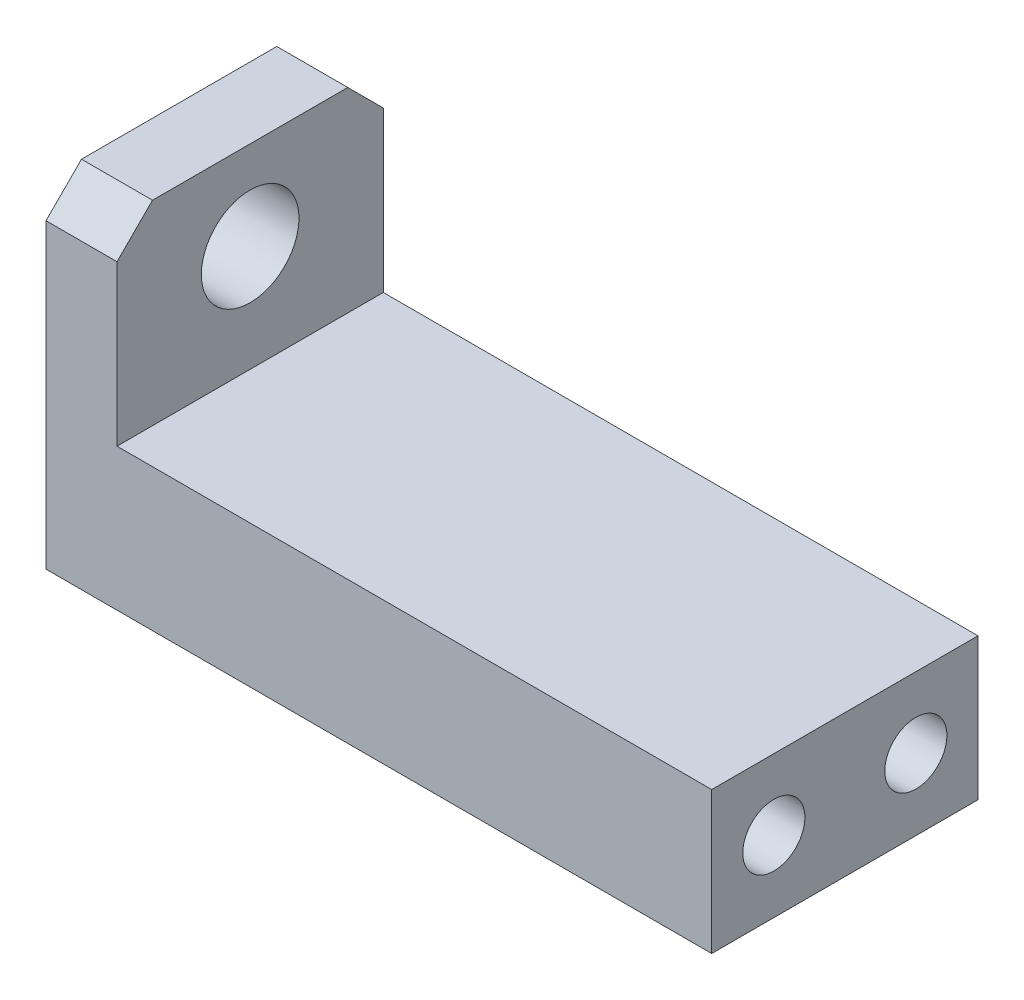
ISO-10303-21;
HEADER;
FILE_DESCRIPTION(('STEP AP214'),'2;1');
FILE_NAME('part.step','',(''),(''),'','','');
FILE_SCHEMA(('AUTOMOTIVE_DESIGN { 1 0 10303 214 1 1 1 1 }'));
ENDSEC;
DATA;
#1=APPLICATION_CONTEXT('core data for automotive mechanical design processes');
#2=APPLICATION_PROTOCOL_DEFINITION('international standard','automotive_design',2000,#1);
#3=PRODUCT_CONTEXT('',#1,'mechanical');
#4=PRODUCT('Part','Part','',(#3));
#5=PRODUCT_RELATED_PRODUCT_CATEGORY('part','',(#4));
#6=PRODUCT_DEFINITION_FORMATION('','',#4);
#7=PRODUCT_DEFINITION_CONTEXT('part definition',#1,'design');
#8=PRODUCT_DEFINITION('design','',#6,#7);
#9=PRODUCT_DEFINITION_SHAPE('','',#8);
#10=(LENGTH_UNIT() NAMED_UNIT(*) SI_UNIT(.MILLI.,.METRE.));
#11=(NAMED_UNIT(*) PLANE_ANGLE_UNIT() SI_UNIT($,.RADIAN.));
#12=(NAMED_UNIT(*) SI_UNIT($,.STERADIAN.) SOLID_ANGLE_UNIT());
#13=UNCERTAINTY_MEASURE_WITH_UNIT(LENGTH_MEASURE(1.E-05),#10,'distance_accuracy_value','');
#14=(GEOMETRIC_REPRESENTATION_CONTEXT(3) GLOBAL_UNCERTAINTY_ASSIGNED_CONTEXT((#13)) GLOBAL_UNIT_ASSIGNED_CONTEXT((#10,
#11,#12)) REPRESENTATION_CONTEXT('',''));
#15=CARTESIAN_POINT('',(0.,0.,0.));
#16=DIRECTION('',(0.,0.,1.));
#17=DIRECTION('',(1.,0.,0.));
#18=AXIS2_PLACEMENT_3D('',#15,#16,#17);
#19=CARTESIAN_POINT('',(-12.1637099173446,-16.9398496240602,15.));
#20=DIRECTION('',(1.,0.,0.));
#21=DIRECTION('',(0.,0.,-1.));
#22=AXIS2_PLACEMENT_3D('',#19,#20,#21);
#23=PLANE('',#22);
#24=CARTESIAN_POINT('',(-12.1637099173446,-12.9147060324,11.5));
#25=DIRECTION('',(-1.,0.,0.));
#26=DIRECTION('',(0.,0.,1.));
#27=AXIS2_PLACEMENT_3D('',#24,#25,#26);
#28=CIRCLE('',#27,3.);
#29=CARTESIAN_POINT('',(-12.1637099173446,-12.9147060324,14.5));
#30=VERTEX_POINT('',#29);
#31=EDGE_CURVE('E194',#30,#30,#28,.T.);
#32=ORIENTED_EDGE('',*,*,#31,.F.);
#33=EDGE_LOOP('',(#32));
#34=FACE_BOUND('',#33,.T.);
#35=CARTESIAN_POINT('',(-12.1637099173446,-12.9147060324,3.5));
#36=DIRECTION('',(-1.,0.,0.));
#37=DIRECTION('',(0.,0.,1.));
#38=AXIS2_PLACEMENT_3D('',#35,#36,#37);
#39=CIRCLE('',#38,3.);
#40=CARTESIAN_POINT('',(-12.1637099173446,-12.9147060324,6.5));
#41=VERTEX_POINT('',#40);
#42=EDGE_CURVE('E187',#41,#41,#39,.T.);
#43=ORIENTED_EDGE('',*,*,#42,.F.);
#44=EDGE_LOOP('',(#43));
#45=FACE_BOUND('',#44,.T.);
#46=CARTESIAN_POINT('',(-12.1637099173446,-2.93984962406015,7.5));
#47=DIRECTION('',(-1.,0.,0.));
#48=DIRECTION('',(0.,0.,1.));
#49=AXIS2_PLACEMENT_3D('',#46,#47,#48);
#50=CIRCLE('',#49,2.75);
#51=CARTESIAN_POINT('',(-12.1637099173446,-2.93984962406015,10.25));
#52=VERTEX_POINT('',#51);
#53=EDGE_CURVE('E133',#52,#52,#50,.T.);
#54=ORIENTED_EDGE('',*,*,#53,.F.);
#55=EDGE_LOOP('',(#54));
#56=FACE_BOUND('',#55,.T.);
#57=DIRECTION('',(0.,0.,-1.));
#58=VECTOR('',#57,1.);
#59=CARTESIAN_POINT('',(-12.1637099173446,2.06015037593985,15.));
#60=LINE('',#59,#58);
#61=CARTESIAN_POINT('',(-12.1637099173446,2.06015037593985,13.));
#62=VERTEX_POINT('',#61);
#63=CARTESIAN_POINT('',(-12.1637099173446,2.06015037593985,1.99999999999999));
#64=VERTEX_POINT('',#63);
#65=EDGE_CURVE('E154',#62,#64,#60,.T.);
#66=ORIENTED_EDGE('',*,*,#65,.T.);
#67=DIRECTION('',(0.,-0.70710678118655,-0.707106781186545));
#68=VECTOR('',#67,1.);
#69=CARTESIAN_POINT('',(-12.1637099173446,2.06015037593985,1.99999999999999));
#70=LINE('',#69,#68);
#71=CARTESIAN_POINT('',(-12.1637099173446,0.0601503759398402,0.));
#72=VERTEX_POINT('',#71);
#73=EDGE_CURVE('E139',#64,#72,#70,.T.);
#74=ORIENTED_EDGE('',*,*,#73,.T.);
#75=DIRECTION('',(0.,-1.,0.));
#76=VECTOR('',#75,1.);
#77=CARTESIAN_POINT('',(-12.1637099173446,-16.9398496240602,0.));
#78=LINE('',#77,#76);
#79=CARTESIAN_POINT('',(-12.1637099173446,-16.9398496240602,0.));
#80=VERTEX_POINT('',#79);
#81=EDGE_CURVE('E121',#72,#80,#78,.T.);
#82=ORIENTED_EDGE('',*,*,#81,.T.);
#83=DIRECTION('',(0.,0.,-1.));
#84=VECTOR('',#83,1.);
#85=CARTESIAN_POINT('',(-12.1637099173446,-16.9398496240602,15.));
#86=LINE('',#85,#84);
#87=CARTESIAN_POINT('',(-12.1637099173446,-16.9398496240602,15.));
#88=VERTEX_POINT('',#87);
#89=EDGE_CURVE('E114',#88,#80,#86,.T.);
#90=ORIENTED_EDGE('',*,*,#89,.F.);
#91=DIRECTION('',(0.,-1.,0.));
#92=VECTOR('',#91,1.);
#93=CARTESIAN_POINT('',(-12.1637099173446,-16.9398496240602,15.));
#94=LINE('',#93,#92);
#95=CARTESIAN_POINT('',(-12.1637099173446,0.0601503759398471,15.));
#96=VERTEX_POINT('',#95);
#97=EDGE_CURVE('E101',#96,#88,#94,.T.);
#98=ORIENTED_EDGE('',*,*,#97,.F.);
#99=DIRECTION('',(0.,-0.707106781186545,0.70710678118655));
#100=VECTOR('',#99,1.);
#101=CARTESIAN_POINT('',(-12.1637099173446,0.0601503759398471,15.));
#102=LINE('',#101,#100);
#103=EDGE_CURVE('E137',#96,#62,#102,.F.);
#104=ORIENTED_EDGE('',*,*,#103,.T.);
#105=EDGE_LOOP('',(#66,#74,#82,#90,#98,#104));
#106=FACE_BOUND('',#105,.T.);
#107=ADVANCED_FACE('F33',(#34,#45,#56,#106),#23,.F.);
#108=CARTESIAN_POINT('',(25.3362900826554,-16.9398496240601,15.));
#109=DIRECTION('',(0.,1.,0.));
#110=DIRECTION('',(-1.,0.,0.));
#111=AXIS2_PLACEMENT_3D('',#108,#109,#110);
#112=PLANE('',#111);
#113=DIRECTION('',(1.,0.,0.));
#114=VECTOR('',#113,1.);
#115=CARTESIAN_POINT('',(25.3362900826554,-16.9398496240601,0.));
#116=LINE('',#115,#114);
#117=CARTESIAN_POINT('',(25.3362900826554,-16.9398496240601,0.));
#118=VERTEX_POINT('',#117);
#119=EDGE_CURVE('E159',#80,#118,#116,.T.);
#120=ORIENTED_EDGE('',*,*,#119,.T.);
#121=DIRECTION('',(0.,0.,-1.));
#122=VECTOR('',#121,1.);
#123=CARTESIAN_POINT('',(25.3362900826554,-16.9398496240601,15.));
#124=LINE('',#123,#122);
#125=CARTESIAN_POINT('',(25.3362900826554,-16.9398496240601,15.));
#126=VERTEX_POINT('',#125);
#127=EDGE_CURVE('E116',#126,#118,#124,.T.);
#128=ORIENTED_EDGE('',*,*,#127,.F.);
#129=DIRECTION('',(1.,0.,0.));
#130=VECTOR('',#129,1.);
#131=CARTESIAN_POINT('',(25.3362900826554,-16.9398496240601,15.));
#132=LINE('',#131,#130);
#133=EDGE_CURVE('E104',#88,#126,#132,.T.);
#134=ORIENTED_EDGE('',*,*,#133,.F.);
#135=ORIENTED_EDGE('',*,*,#89,.T.);
#136=EDGE_LOOP('',(#120,#128,#134,#135));
#137=FACE_BOUND('',#136,.T.);
#138=ADVANCED_FACE('F113',(#137),#112,.F.);
#139=CARTESIAN_POINT('',(25.3362900826554,-8.93984962406015,15.));
#140=DIRECTION('',(-1.,0.,0.));
#141=DIRECTION('',(0.,0.,1.));
#142=AXIS2_PLACEMENT_3D('',#139,#140,#141);
#143=PLANE('',#142);
#144=CARTESIAN_POINT('',(25.3362900826554,-12.9147060324,11.5));
#145=DIRECTION('',(-1.,0.,0.));
#146=DIRECTION('',(0.,0.,1.));
#147=AXIS2_PLACEMENT_3D('',#144,#145,#146);
#148=CIRCLE('',#147,1.75);
#149=CARTESIAN_POINT('',(25.3362900826554,-12.9147060324,13.25));
#150=VERTEX_POINT('',#149);
#151=EDGE_CURVE('E207',#150,#150,#148,.T.);
#152=ORIENTED_EDGE('',*,*,#151,.T.);
#153=EDGE_LOOP('',(#152));
#154=FACE_BOUND('',#153,.T.);
#155=CARTESIAN_POINT('',(25.3362900826554,-12.9147060324,3.5));
#156=DIRECTION('',(-1.,0.,0.));
#157=DIRECTION('',(0.,0.,1.));
#158=AXIS2_PLACEMENT_3D('',#155,#156,#157);
#159=CIRCLE('',#158,1.75);
#160=CARTESIAN_POINT('',(25.3362900826554,-12.9147060324,5.25));
#161=VERTEX_POINT('',#160);
#162=EDGE_CURVE('E201',#161,#161,#159,.T.);
#163=ORIENTED_EDGE('',*,*,#162,.T.);
#164=EDGE_LOOP('',(#163));
#165=FACE_BOUND('',#164,.T.);
#166=DIRECTION('',(0.,1.,0.));
#167=VECTOR('',#166,1.);
#168=CARTESIAN_POINT('',(25.3362900826554,-8.93984962406015,0.));
#169=LINE('',#168,#167);
#170=CARTESIAN_POINT('',(25.3362900826554,-8.93984962406015,0.));
#171=VERTEX_POINT('',#170);
#172=EDGE_CURVE('E161',#118,#171,#169,.T.);
#173=ORIENTED_EDGE('',*,*,#172,.T.);
#174=DIRECTION('',(0.,0.,-1.));
#175=VECTOR('',#174,1.);
#176=CARTESIAN_POINT('',(25.3362900826554,-8.93984962406015,15.));
#177=LINE('',#176,#175);
#178=CARTESIAN_POINT('',(25.3362900826554,-8.93984962406015,15.));
#179=VERTEX_POINT('',#178);
#180=EDGE_CURVE('E127',#179,#171,#177,.T.);
#181=ORIENTED_EDGE('',*,*,#180,.F.);
#182=DIRECTION('',(0.,1.,0.));
#183=VECTOR('',#182,1.);
#184=CARTESIAN_POINT('',(25.3362900826554,-8.93984962406015,15.));
#185=LINE('',#184,#183);
#186=EDGE_CURVE('E118',#126,#179,#185,.T.);
#187=ORIENTED_EDGE('',*,*,#186,.F.);
#188=ORIENTED_EDGE('',*,*,#127,.T.);
#189=EDGE_LOOP('',(#173,#181,#187,#188));
#190=FACE_BOUND('',#189,.T.);
#191=ADVANCED_FACE('F181',(#154,#165,#190),#143,.F.);
#192=CARTESIAN_POINT('',(-8.16370991734465,-8.93984962406015,15.));
#193=DIRECTION('',(0.,-1.,0.));
#194=DIRECTION('',(0.,0.,-1.));
#195=AXIS2_PLACEMENT_3D('',#192,#193,#194);
#196=PLANE('',#195);
#197=DIRECTION('',(-1.,0.,0.));
#198=VECTOR('',#197,1.);
#199=CARTESIAN_POINT('',(-8.16370991734465,-8.93984962406015,0.));
#200=LINE('',#199,#198);
#201=CARTESIAN_POINT('',(-8.16370991734465,-8.93984962406015,0.));
#202=VERTEX_POINT('',#201);
#203=EDGE_CURVE('E168',#171,#202,#200,.T.);
#204=ORIENTED_EDGE('',*,*,#203,.T.);
#205=DIRECTION('',(0.,0.,-1.));
#206=VECTOR('',#205,1.);
#207=CARTESIAN_POINT('',(-8.16370991734465,-8.93984962406015,15.));
#208=LINE('',#207,#206);
#209=CARTESIAN_POINT('',(-8.16370991734465,-8.93984962406015,15.));
#210=VERTEX_POINT('',#209);
#211=EDGE_CURVE('E153',#210,#202,#208,.T.);
#212=ORIENTED_EDGE('',*,*,#211,.F.);
#213=DIRECTION('',(-1.,0.,0.));
#214=VECTOR('',#213,1.);
#215=CARTESIAN_POINT('',(-8.16370991734465,-8.93984962406015,15.));
#216=LINE('',#215,#214);
#217=EDGE_CURVE('E179',#179,#210,#216,.T.);
#218=ORIENTED_EDGE('',*,*,#217,.F.);
#219=ORIENTED_EDGE('',*,*,#180,.T.);
#220=EDGE_LOOP('',(#204,#212,#218,#219));
#221=FACE_BOUND('',#220,.T.);
#222=ADVANCED_FACE('F177',(#221),#196,.F.);
#223=CARTESIAN_POINT('',(-8.16370991734465,2.06015037593985,15.));
#224=DIRECTION('',(-1.,0.,0.));
#225=DIRECTION('',(0.,0.,1.));
#226=AXIS2_PLACEMENT_3D('',#223,#224,#225);
#227=PLANE('',#226);
#228=CARTESIAN_POINT('',(-8.16370991734465,-2.93984962406015,7.5));
#229=DIRECTION('',(-1.,0.,0.));
#230=DIRECTION('',(0.,0.,1.));
#231=AXIS2_PLACEMENT_3D('',#228,#229,#230);
#232=CIRCLE('',#231,2.75);
#233=CARTESIAN_POINT('',(-8.16370991734465,-2.93984962406015,10.25));
#234=VERTEX_POINT('',#233);
#235=EDGE_CURVE('E131',#234,#234,#232,.T.);
#236=ORIENTED_EDGE('',*,*,#235,.T.);
#237=EDGE_LOOP('',(#236));
#238=FACE_BOUND('',#237,.T.);
#239=DIRECTION('',(0.,1.,0.));
#240=VECTOR('',#239,1.);
#241=CARTESIAN_POINT('',(-8.16370991734465,2.06015037593985,0.));
#242=LINE('',#241,#240);
#243=CARTESIAN_POINT('',(-8.16370991734465,0.0601503759398402,0.));
#244=VERTEX_POINT('',#243);
#245=EDGE_CURVE('E109',#202,#244,#242,.T.);
#246=ORIENTED_EDGE('',*,*,#245,.T.);
#247=DIRECTION('',(0.,0.70710678118655,0.707106781186545));
#248=VECTOR('',#247,1.);
#249=CARTESIAN_POINT('',(-8.16370991734465,2.06015037593985,1.99999999999999));
#250=LINE('',#249,#248);
#251=CARTESIAN_POINT('',(-8.16370991734465,2.06015037593985,1.99999999999999));
#252=VERTEX_POINT('',#251);
#253=EDGE_CURVE('E41',#244,#252,#250,.T.);
#254=ORIENTED_EDGE('',*,*,#253,.T.);
#255=DIRECTION('',(0.,0.,-1.));
#256=VECTOR('',#255,1.);
#257=CARTESIAN_POINT('',(-8.16370991734465,2.06015037593985,15.));
#258=LINE('',#257,#256);
#259=CARTESIAN_POINT('',(-8.16370991734465,2.06015037593985,13.));
#260=VERTEX_POINT('',#259);
#261=EDGE_CURVE('E145',#260,#252,#258,.T.);
#262=ORIENTED_EDGE('',*,*,#261,.F.);
#263=DIRECTION('',(0.,0.707106781186545,-0.70710678118655));
#264=VECTOR('',#263,1.);
#265=CARTESIAN_POINT('',(-8.16370991734465,0.0601503759398471,15.));
#266=LINE('',#265,#264);
#267=CARTESIAN_POINT('',(-8.16370991734465,0.0601503759398471,15.));
#268=VERTEX_POINT('',#267);
#269=EDGE_CURVE('E48',#260,#268,#266,.F.);
#270=ORIENTED_EDGE('',*,*,#269,.T.);
#271=DIRECTION('',(0.,1.,0.));
#272=VECTOR('',#271,1.);
#273=CARTESIAN_POINT('',(-8.16370991734465,2.06015037593985,15.));
#274=LINE('',#273,#272);
#275=EDGE_CURVE('E164',#210,#268,#274,.T.);
#276=ORIENTED_EDGE('',*,*,#275,.F.);
#277=ORIENTED_EDGE('',*,*,#211,.T.);
#278=EDGE_LOOP('',(#246,#254,#262,#270,#276,#277));
#279=FACE_BOUND('',#278,.T.);
#280=ADVANCED_FACE('F144',(#238,#279),#227,.F.);
#281=CARTESIAN_POINT('',(-12.1637099173446,2.06015037593985,15.));
#282=DIRECTION('',(0.,-1.,0.));
#283=DIRECTION('',(0.,0.,-1.));
#284=AXIS2_PLACEMENT_3D('',#281,#282,#283);
#285=PLANE('',#284);
#286=ORIENTED_EDGE('',*,*,#261,.T.);
#287=DIRECTION('',(-1.,0.,0.));
#288=VECTOR('',#287,1.);
#289=CARTESIAN_POINT('',(-12.1637099173446,2.06015037593985,1.99999999999999));
#290=LINE('',#289,#288);
#291=EDGE_CURVE('E125',#252,#64,#290,.T.);
#292=ORIENTED_EDGE('',*,*,#291,.T.);
#293=ORIENTED_EDGE('',*,*,#65,.F.);
#294=DIRECTION('',(1.,0.,0.));
#295=VECTOR('',#294,1.);
#296=CARTESIAN_POINT('',(-12.1637099173446,2.06015037593985,13.));
#297=LINE('',#296,#295);
#298=EDGE_CURVE('E123',#62,#260,#297,.T.);
#299=ORIENTED_EDGE('',*,*,#298,.T.);
#300=EDGE_LOOP('',(#286,#292,#293,#299));
#301=FACE_BOUND('',#300,.T.);
#302=ADVANCED_FACE('F150',(#301),#285,.F.);
#303=CARTESIAN_POINT('',(0.,0.,15.));
#304=DIRECTION('',(0.,0.,-1.));
#305=DIRECTION('',(-1.,0.,0.));
#306=AXIS2_PLACEMENT_3D('',#303,#304,#305);
#307=PLANE('',#306);
#308=ORIENTED_EDGE('',*,*,#275,.T.);
#309=DIRECTION('',(-1.,0.,0.));
#310=VECTOR('',#309,1.);
#311=CARTESIAN_POINT('',(0.,0.0601503759398471,15.));
#312=LINE('',#311,#310);
#313=EDGE_CURVE('E11',#268,#96,#312,.T.);
#314=ORIENTED_EDGE('',*,*,#313,.T.);
#315=ORIENTED_EDGE('',*,*,#97,.T.);
#316=ORIENTED_EDGE('',*,*,#133,.T.);
#317=ORIENTED_EDGE('',*,*,#186,.T.);
#318=ORIENTED_EDGE('',*,*,#217,.T.);
#319=EDGE_LOOP('',(#308,#314,#315,#316,#317,#318));
#320=FACE_BOUND('',#319,.T.);
#321=ADVANCED_FACE('F103',(#320),#307,.F.);
#322=CARTESIAN_POINT('',(0.,0.,0.));
#323=DIRECTION('',(0.,0.,-1.));
#324=DIRECTION('',(-1.,0.,0.));
#325=AXIS2_PLACEMENT_3D('',#322,#323,#324);
#326=PLANE('',#325);
#327=ORIENTED_EDGE('',*,*,#81,.F.);
#328=DIRECTION('',(1.,0.,0.));
#329=VECTOR('',#328,1.);
#330=CARTESIAN_POINT('',(-8.16370991734465,0.0601503759398402,0.));
#331=LINE('',#330,#329);
#332=EDGE_CURVE('E56',#72,#244,#331,.T.);
#333=ORIENTED_EDGE('',*,*,#332,.T.);
#334=ORIENTED_EDGE('',*,*,#245,.F.);
#335=ORIENTED_EDGE('',*,*,#203,.F.);
#336=ORIENTED_EDGE('',*,*,#172,.F.);
#337=ORIENTED_EDGE('',*,*,#119,.F.);
#338=EDGE_LOOP('',(#327,#333,#334,#335,#336,#337));
#339=FACE_BOUND('',#338,.T.);
#340=ADVANCED_FACE('F157',(#339),#326,.T.);
#341=CARTESIAN_POINT('',(2.83629008265535,-2.93984962406015,7.5));
#342=DIRECTION('',(-1.,0.,0.));
#343=DIRECTION('',(0.,0.,1.));
#344=AXIS2_PLACEMENT_3D('',#341,#342,#343);
#345=CYLINDRICAL_SURFACE('',#344,2.75);
#346=ORIENTED_EDGE('',*,*,#53,.T.);
#347=EDGE_LOOP('',(#346));
#348=FACE_BOUND('',#347,.T.);
#349=ORIENTED_EDGE('',*,*,#235,.F.);
#350=EDGE_LOOP('',(#349));
#351=FACE_BOUND('',#350,.T.);
#352=ADVANCED_FACE('F246',(#348,#351),#345,.F.);
#353=CARTESIAN_POINT('',(2.83629008265535,-12.9147060324,3.5));
#354=DIRECTION('',(-1.,0.,0.));
#355=DIRECTION('',(0.,0.,1.));
#356=AXIS2_PLACEMENT_3D('',#353,#354,#355);
#357=CYLINDRICAL_SURFACE('',#356,3.);
#358=CARTESIAN_POINT('',(2.83629008265535,-12.9147060324,3.5));
#359=DIRECTION('',(-1.,0.,0.));
#360=DIRECTION('',(0.,0.,1.));
#361=AXIS2_PLACEMENT_3D('',#358,#359,#360);
#362=CIRCLE('',#361,3.);
#363=CARTESIAN_POINT('',(2.83629008265535,-12.9147060324,6.5));
#364=VERTEX_POINT('',#363);
#365=EDGE_CURVE('E190',#364,#364,#362,.T.);
#366=ORIENTED_EDGE('',*,*,#365,.F.);
#367=EDGE_LOOP('',(#366));
#368=FACE_BOUND('',#367,.T.);
#369=ORIENTED_EDGE('',*,*,#42,.T.);
#370=EDGE_LOOP('',(#369));
#371=FACE_BOUND('',#370,.T.);
#372=ADVANCED_FACE('F251',(#368,#371),#357,.F.);
#373=CARTESIAN_POINT('',(2.83629008265535,-12.9147060324,3.5));
#374=DIRECTION('',(-1.,0.,0.));
#375=DIRECTION('',(0.,0.,1.));
#376=AXIS2_PLACEMENT_3D('',#373,#374,#375);
#377=PLANE('',#376);
#378=CARTESIAN_POINT('',(2.83629008265535,-12.9147060324,3.5));
#379=DIRECTION('',(-1.,0.,0.));
#380=DIRECTION('',(0.,0.,1.));
#381=AXIS2_PLACEMENT_3D('',#378,#379,#380);
#382=CIRCLE('',#381,1.75);
#383=CARTESIAN_POINT('',(2.83629008265535,-12.9147060324,5.25));
#384=VERTEX_POINT('',#383);
#385=EDGE_CURVE('E191',#384,#384,#382,.T.);
#386=ORIENTED_EDGE('',*,*,#385,.F.);
#387=EDGE_LOOP('',(#386));
#388=FACE_BOUND('',#387,.T.);
#389=ORIENTED_EDGE('',*,*,#365,.T.);
#390=EDGE_LOOP('',(#389));
#391=FACE_BOUND('',#390,.T.);
#392=ADVANCED_FACE('F255',(#388,#391),#377,.T.);
#393=CARTESIAN_POINT('',(2.83629008265535,-12.9147060324,11.5));
#394=DIRECTION('',(-1.,0.,0.));
#395=DIRECTION('',(0.,0.,1.));
#396=AXIS2_PLACEMENT_3D('',#393,#394,#395);
#397=CYLINDRICAL_SURFACE('',#396,3.);
#398=CARTESIAN_POINT('',(2.83629008265535,-12.9147060324,11.5));
#399=DIRECTION('',(-1.,0.,0.));
#400=DIRECTION('',(0.,0.,1.));
#401=AXIS2_PLACEMENT_3D('',#398,#399,#400);
#402=CIRCLE('',#401,3.);
#403=CARTESIAN_POINT('',(2.83629008265535,-12.9147060324,14.5));
#404=VERTEX_POINT('',#403);
#405=EDGE_CURVE('E186',#404,#404,#402,.T.);
#406=ORIENTED_EDGE('',*,*,#405,.F.);
#407=EDGE_LOOP('',(#406));
#408=FACE_BOUND('',#407,.T.);
#409=ORIENTED_EDGE('',*,*,#31,.T.);
#410=EDGE_LOOP('',(#409));
#411=FACE_BOUND('',#410,.T.);
#412=ADVANCED_FACE('F259',(#408,#411),#397,.F.);
#413=CARTESIAN_POINT('',(2.83629008265535,-12.9147060324,11.5));
#414=DIRECTION('',(-1.,0.,0.));
#415=DIRECTION('',(0.,0.,1.));
#416=AXIS2_PLACEMENT_3D('',#413,#414,#415);
#417=PLANE('',#416);
#418=CARTESIAN_POINT('',(2.83629008265535,-12.9147060324,11.5));
#419=DIRECTION('',(-1.,0.,0.));
#420=DIRECTION('',(0.,0.,1.));
#421=AXIS2_PLACEMENT_3D('',#418,#419,#420);
#422=CIRCLE('',#421,1.75);
#423=CARTESIAN_POINT('',(2.83629008265535,-12.9147060324,13.25));
#424=VERTEX_POINT('',#423);
#425=EDGE_CURVE('E204',#424,#424,#422,.T.);
#426=ORIENTED_EDGE('',*,*,#425,.F.);
#427=EDGE_LOOP('',(#426));
#428=FACE_BOUND('',#427,.T.);
#429=ORIENTED_EDGE('',*,*,#405,.T.);
#430=EDGE_LOOP('',(#429));
#431=FACE_BOUND('',#430,.T.);
#432=ADVANCED_FACE('F222',(#428,#431),#417,.T.);
#433=CARTESIAN_POINT('',(25.3362900826554,-12.9147060324,3.5));
#434=DIRECTION('',(-1.,0.,0.));
#435=DIRECTION('',(0.,0.,1.));
#436=AXIS2_PLACEMENT_3D('',#433,#434,#435);
#437=CYLINDRICAL_SURFACE('',#436,1.75);
#438=ORIENTED_EDGE('',*,*,#385,.T.);
#439=EDGE_LOOP('',(#438));
#440=FACE_BOUND('',#439,.T.);
#441=ORIENTED_EDGE('',*,*,#162,.F.);
#442=EDGE_LOOP('',(#441));
#443=FACE_BOUND('',#442,.T.);
#444=ADVANCED_FACE('F215',(#440,#443),#437,.F.);
#445=CARTESIAN_POINT('',(25.3362900826554,-12.9147060324,11.5));
#446=DIRECTION('',(-1.,0.,0.));
#447=DIRECTION('',(0.,0.,1.));
#448=AXIS2_PLACEMENT_3D('',#445,#446,#447);
#449=CYLINDRICAL_SURFACE('',#448,1.75);
#450=ORIENTED_EDGE('',*,*,#425,.T.);
#451=EDGE_LOOP('',(#450));
#452=FACE_BOUND('',#451,.T.);
#453=ORIENTED_EDGE('',*,*,#151,.F.);
#454=EDGE_LOOP('',(#453));
#455=FACE_BOUND('',#454,.T.);
#456=ADVANCED_FACE('F213',(#452,#455),#449,.F.);
#457=CARTESIAN_POINT('',(-12.1637099173446,2.06015037593985,1.99999999999999));
#458=DIRECTION('',(0.,0.707106781186545,-0.70710678118655));
#459=DIRECTION('',(1.,0.,0.));
#460=AXIS2_PLACEMENT_3D('',#457,#458,#459);
#461=PLANE('',#460);
#462=ORIENTED_EDGE('',*,*,#253,.F.);
#463=ORIENTED_EDGE('',*,*,#332,.F.);
#464=ORIENTED_EDGE('',*,*,#73,.F.);
#465=ORIENTED_EDGE('',*,*,#291,.F.);
#466=EDGE_LOOP('',(#462,#463,#464,#465));
#467=FACE_BOUND('',#466,.T.);
#468=ADVANCED_FACE('F156',(#467),#461,.T.);
#469=CARTESIAN_POINT('',(0.,0.0601503759398471,15.));
#470=DIRECTION('',(0.,-0.70710678118655,-0.707106781186545));
#471=DIRECTION('',(-1.,0.,0.));
#472=AXIS2_PLACEMENT_3D('',#469,#470,#471);
#473=PLANE('',#472);
#474=ORIENTED_EDGE('',*,*,#269,.F.);
#475=ORIENTED_EDGE('',*,*,#298,.F.);
#476=ORIENTED_EDGE('',*,*,#103,.F.);
#477=ORIENTED_EDGE('',*,*,#313,.F.);
#478=EDGE_LOOP('',(#474,#475,#476,#477));
#479=FACE_BOUND('',#478,.T.);
#480=ADVANCED_FACE('F35',(#479),#473,.F.);
#481=CLOSED_SHELL('',(#107,#138,#191,#222,#280,#302,#321,#340,#352,#372,#392,#412,#432,#444,
#456,#468,#480));
#482=MANIFOLD_SOLID_BREP('B2',#481);
#483=ADVANCED_BREP_SHAPE_REPRESENTATION('',(#18,#482),#14);
#484=SHAPE_DEFINITION_REPRESENTATION(#9,#483);
ENDSEC;
END-ISO-10303-21;
